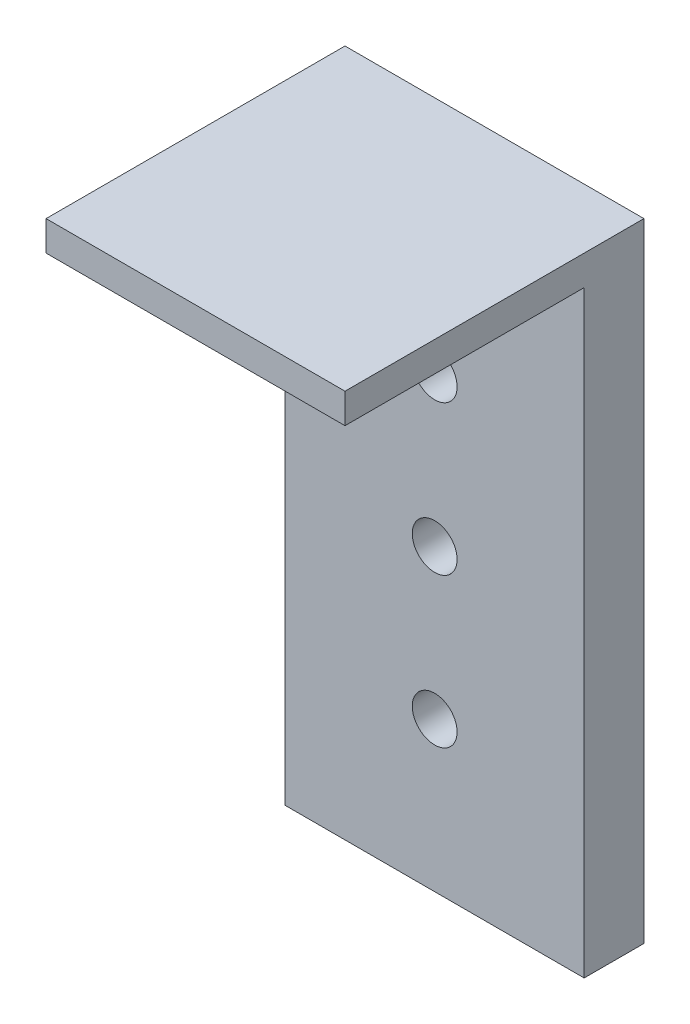
ISO-10303-21;
HEADER;
FILE_DESCRIPTION(('STEP AP214'),'2;1');
FILE_NAME('part.step','',(''),(''),'','','');
FILE_SCHEMA(('AUTOMOTIVE_DESIGN { 1 0 10303 214 1 1 1 1 }'));
ENDSEC;
DATA;
#1=APPLICATION_CONTEXT('core data for automotive mechanical design processes');
#2=APPLICATION_PROTOCOL_DEFINITION('international standard','automotive_design',2000,#1);
#3=PRODUCT_CONTEXT('',#1,'mechanical');
#4=PRODUCT('Part','Part','',(#3));
#5=PRODUCT_RELATED_PRODUCT_CATEGORY('part','',(#4));
#6=PRODUCT_DEFINITION_FORMATION('','',#4);
#7=PRODUCT_DEFINITION_CONTEXT('part definition',#1,'design');
#8=PRODUCT_DEFINITION('design','',#6,#7);
#9=PRODUCT_DEFINITION_SHAPE('','',#8);
#10=(LENGTH_UNIT() NAMED_UNIT(*) SI_UNIT(.MILLI.,.METRE.));
#11=(NAMED_UNIT(*) PLANE_ANGLE_UNIT() SI_UNIT($,.RADIAN.));
#12=(NAMED_UNIT(*) SI_UNIT($,.STERADIAN.) SOLID_ANGLE_UNIT());
#13=UNCERTAINTY_MEASURE_WITH_UNIT(LENGTH_MEASURE(1.E-05),#10,'distance_accuracy_value','');
#14=(GEOMETRIC_REPRESENTATION_CONTEXT(3) GLOBAL_UNCERTAINTY_ASSIGNED_CONTEXT((#13)) GLOBAL_UNIT_ASSIGNED_CONTEXT((#10,
#11,#12)) REPRESENTATION_CONTEXT('',''));
#15=CARTESIAN_POINT('',(0.,0.,0.));
#16=DIRECTION('',(0.,0.,1.));
#17=DIRECTION('',(1.,0.,0.));
#18=AXIS2_PLACEMENT_3D('',#15,#16,#17);
#19=CARTESIAN_POINT('',(0.,9.7150517009582,2.));
#20=DIRECTION('',(1.,0.,0.));
#21=DIRECTION('',(0.,0.,-1.));
#22=AXIS2_PLACEMENT_3D('',#19,#20,#21);
#23=PLANE('',#22);
#24=DIRECTION('',(0.,-1.,0.));
#25=VECTOR('',#24,1.);
#26=CARTESIAN_POINT('',(0.,9.7150517009582,0.));
#27=LINE('',#26,#25);
#28=CARTESIAN_POINT('',(0.,30.7150517009582,0.));
#29=VERTEX_POINT('',#28);
#30=CARTESIAN_POINT('',(0.,9.7150517009582,0.));
#31=VERTEX_POINT('',#30);
#32=EDGE_CURVE('E102',#29,#31,#27,.T.);
#33=ORIENTED_EDGE('',*,*,#32,.T.);
#34=DIRECTION('',(0.,0.,-1.));
#35=VECTOR('',#34,1.);
#36=CARTESIAN_POINT('',(0.,9.7150517009582,2.));
#37=LINE('',#36,#35);
#38=CARTESIAN_POINT('',(0.,9.7150517009582,2.));
#39=VERTEX_POINT('',#38);
#40=EDGE_CURVE('E11',#39,#31,#37,.T.);
#41=ORIENTED_EDGE('',*,*,#40,.F.);
#42=DIRECTION('',(0.,-1.,0.));
#43=VECTOR('',#42,1.);
#44=CARTESIAN_POINT('',(0.,9.7150517009582,2.));
#45=LINE('',#44,#43);
#46=CARTESIAN_POINT('',(0.,29.7150517009582,2.));
#47=VERTEX_POINT('',#46);
#48=EDGE_CURVE('E93',#47,#39,#45,.T.);
#49=ORIENTED_EDGE('',*,*,#48,.F.);
#50=DIRECTION('',(0.,0.,1.));
#51=VECTOR('',#50,1.);
#52=CARTESIAN_POINT('',(0.,29.7150517009582,0.));
#53=LINE('',#52,#51);
#54=CARTESIAN_POINT('',(0.,29.7150517009582,10.));
#55=VERTEX_POINT('',#54);
#56=EDGE_CURVE('E55',#47,#55,#53,.T.);
#57=ORIENTED_EDGE('',*,*,#56,.T.);
#58=DIRECTION('',(0.,-1.,0.));
#59=VECTOR('',#58,1.);
#60=CARTESIAN_POINT('',(0.,30.7150517009582,10.));
#61=LINE('',#60,#59);
#62=CARTESIAN_POINT('',(0.,30.7150517009582,10.));
#63=VERTEX_POINT('',#62);
#64=EDGE_CURVE('E132',#63,#55,#61,.T.);
#65=ORIENTED_EDGE('',*,*,#64,.F.);
#66=DIRECTION('',(0.,0.,1.));
#67=VECTOR('',#66,1.);
#68=CARTESIAN_POINT('',(0.,30.7150517009582,0.));
#69=LINE('',#68,#67);
#70=EDGE_CURVE('E105',#29,#63,#69,.T.);
#71=ORIENTED_EDGE('',*,*,#70,.F.);
#72=EDGE_LOOP('',(#33,#41,#49,#57,#65,#71));
#73=FACE_BOUND('',#72,.T.);
#74=ADVANCED_FACE('F38',(#73),#23,.F.);
#75=CARTESIAN_POINT('',(0.,9.7150517009582,2.));
#76=DIRECTION('',(0.,1.,0.));
#77=DIRECTION('',(0.,0.,1.));
#78=AXIS2_PLACEMENT_3D('',#75,#76,#77);
#79=PLANE('',#78);
#80=DIRECTION('',(1.,0.,0.));
#81=VECTOR('',#80,1.);
#82=CARTESIAN_POINT('',(0.,9.7150517009582,0.));
#83=LINE('',#82,#81);
#84=CARTESIAN_POINT('',(10.,9.7150517009582,0.));
#85=VERTEX_POINT('',#84);
#86=EDGE_CURVE('E68',#31,#85,#83,.T.);
#87=ORIENTED_EDGE('',*,*,#86,.T.);
#88=DIRECTION('',(0.,0.,-1.));
#89=VECTOR('',#88,1.);
#90=CARTESIAN_POINT('',(10.,9.7150517009582,2.));
#91=LINE('',#90,#89);
#92=CARTESIAN_POINT('',(10.,9.7150517009582,2.));
#93=VERTEX_POINT('',#92);
#94=EDGE_CURVE('E47',#93,#85,#91,.T.);
#95=ORIENTED_EDGE('',*,*,#94,.F.);
#96=DIRECTION('',(1.,0.,0.));
#97=VECTOR('',#96,1.);
#98=CARTESIAN_POINT('',(0.,9.7150517009582,2.));
#99=LINE('',#98,#97);
#100=EDGE_CURVE('E82',#39,#93,#99,.T.);
#101=ORIENTED_EDGE('',*,*,#100,.F.);
#102=ORIENTED_EDGE('',*,*,#40,.T.);
#103=EDGE_LOOP('',(#87,#95,#101,#102));
#104=FACE_BOUND('',#103,.T.);
#105=ADVANCED_FACE('F84',(#104),#79,.F.);
#106=CARTESIAN_POINT('',(10.,9.7150517009582,2.));
#107=DIRECTION('',(-1.,0.,0.));
#108=DIRECTION('',(0.,0.,1.));
#109=AXIS2_PLACEMENT_3D('',#106,#107,#108);
#110=PLANE('',#109);
#111=DIRECTION('',(0.,1.,0.));
#112=VECTOR('',#111,1.);
#113=CARTESIAN_POINT('',(10.,9.7150517009582,0.));
#114=LINE('',#113,#112);
#115=CARTESIAN_POINT('',(10.,30.7150517009582,0.));
#116=VERTEX_POINT('',#115);
#117=EDGE_CURVE('E99',#85,#116,#114,.T.);
#118=ORIENTED_EDGE('',*,*,#117,.T.);
#119=DIRECTION('',(0.,0.,-1.));
#120=VECTOR('',#119,1.);
#121=CARTESIAN_POINT('',(10.,30.7150517009582,0.));
#122=LINE('',#121,#120);
#123=CARTESIAN_POINT('',(10.,30.7150517009582,10.));
#124=VERTEX_POINT('',#123);
#125=EDGE_CURVE('E166',#124,#116,#122,.T.);
#126=ORIENTED_EDGE('',*,*,#125,.F.);
#127=DIRECTION('',(0.,-1.,0.));
#128=VECTOR('',#127,1.);
#129=CARTESIAN_POINT('',(10.,30.7150517009582,10.));
#130=LINE('',#129,#128);
#131=CARTESIAN_POINT('',(10.,29.7150517009582,10.));
#132=VERTEX_POINT('',#131);
#133=EDGE_CURVE('E150',#124,#132,#130,.T.);
#134=ORIENTED_EDGE('',*,*,#133,.T.);
#135=DIRECTION('',(0.,0.,-1.));
#136=VECTOR('',#135,1.);
#137=CARTESIAN_POINT('',(10.,29.7150517009582,0.));
#138=LINE('',#137,#136);
#139=CARTESIAN_POINT('',(10.,29.7150517009582,2.));
#140=VERTEX_POINT('',#139);
#141=EDGE_CURVE('E155',#132,#140,#138,.T.);
#142=ORIENTED_EDGE('',*,*,#141,.T.);
#143=DIRECTION('',(0.,1.,0.));
#144=VECTOR('',#143,1.);
#145=CARTESIAN_POINT('',(10.,9.7150517009582,2.));
#146=LINE('',#145,#144);
#147=EDGE_CURVE('E92',#93,#140,#146,.T.);
#148=ORIENTED_EDGE('',*,*,#147,.F.);
#149=ORIENTED_EDGE('',*,*,#94,.T.);
#150=EDGE_LOOP('',(#118,#126,#134,#142,#148,#149));
#151=FACE_BOUND('',#150,.T.);
#152=ADVANCED_FACE('F188',(#151),#110,.F.);
#153=CARTESIAN_POINT('',(0.,0.,2.));
#154=DIRECTION('',(0.,0.,-1.));
#155=DIRECTION('',(-1.,0.,0.));
#156=AXIS2_PLACEMENT_3D('',#153,#154,#155);
#157=PLANE('',#156);
#158=CARTESIAN_POINT('',(5.,24.7150517009582,2.));
#159=DIRECTION('',(0.,0.,1.));
#160=DIRECTION('',(1.,0.,0.));
#161=AXIS2_PLACEMENT_3D('',#158,#159,#160);
#162=CIRCLE('',#161,0.75);
#163=CARTESIAN_POINT('',(5.75,24.7150517009582,2.));
#164=VERTEX_POINT('',#163);
#165=EDGE_CURVE('E109',#164,#164,#162,.T.);
#166=ORIENTED_EDGE('',*,*,#165,.F.);
#167=EDGE_LOOP('',(#166));
#168=FACE_BOUND('',#167,.T.);
#169=CARTESIAN_POINT('',(5.,19.7150517009582,2.));
#170=DIRECTION('',(0.,0.,1.));
#171=DIRECTION('',(1.,0.,0.));
#172=AXIS2_PLACEMENT_3D('',#169,#170,#171);
#173=CIRCLE('',#172,0.75);
#174=CARTESIAN_POINT('',(5.75,19.7150517009582,2.));
#175=VERTEX_POINT('',#174);
#176=EDGE_CURVE('E140',#175,#175,#173,.T.);
#177=ORIENTED_EDGE('',*,*,#176,.F.);
#178=EDGE_LOOP('',(#177));
#179=FACE_BOUND('',#178,.T.);
#180=CARTESIAN_POINT('',(5.,14.7150517009582,2.));
#181=DIRECTION('',(0.,0.,1.));
#182=DIRECTION('',(1.,0.,0.));
#183=AXIS2_PLACEMENT_3D('',#180,#181,#182);
#184=CIRCLE('',#183,0.75);
#185=CARTESIAN_POINT('',(5.75,14.7150517009582,2.));
#186=VERTEX_POINT('',#185);
#187=EDGE_CURVE('E131',#186,#186,#184,.T.);
#188=ORIENTED_EDGE('',*,*,#187,.F.);
#189=EDGE_LOOP('',(#188));
#190=FACE_BOUND('',#189,.T.);
#191=ORIENTED_EDGE('',*,*,#48,.T.);
#192=ORIENTED_EDGE('',*,*,#100,.T.);
#193=ORIENTED_EDGE('',*,*,#147,.T.);
#194=DIRECTION('',(-1.,0.,0.));
#195=VECTOR('',#194,1.);
#196=CARTESIAN_POINT('',(0.,29.7150517009582,2.));
#197=LINE('',#196,#195);
#198=EDGE_CURVE('E72',#140,#47,#197,.T.);
#199=ORIENTED_EDGE('',*,*,#198,.T.);
#200=EDGE_LOOP('',(#191,#192,#193,#199));
#201=FACE_BOUND('',#200,.T.);
#202=ADVANCED_FACE('F96',(#168,#179,#190,#201),#157,.F.);
#203=CARTESIAN_POINT('',(0.,0.,0.));
#204=DIRECTION('',(0.,0.,-1.));
#205=DIRECTION('',(-1.,0.,0.));
#206=AXIS2_PLACEMENT_3D('',#203,#204,#205);
#207=PLANE('',#206);
#208=CARTESIAN_POINT('',(5.,24.7150517009582,0.));
#209=DIRECTION('',(0.,0.,1.));
#210=DIRECTION('',(1.,0.,0.));
#211=AXIS2_PLACEMENT_3D('',#208,#209,#210);
#212=CIRCLE('',#211,0.75);
#213=CARTESIAN_POINT('',(5.75,24.7150517009582,0.));
#214=VERTEX_POINT('',#213);
#215=EDGE_CURVE('E115',#214,#214,#212,.T.);
#216=ORIENTED_EDGE('',*,*,#215,.T.);
#217=EDGE_LOOP('',(#216));
#218=FACE_BOUND('',#217,.T.);
#219=CARTESIAN_POINT('',(5.,19.7150517009582,0.));
#220=DIRECTION('',(0.,0.,1.));
#221=DIRECTION('',(1.,0.,0.));
#222=AXIS2_PLACEMENT_3D('',#219,#220,#221);
#223=CIRCLE('',#222,0.75);
#224=CARTESIAN_POINT('',(5.75,19.7150517009582,0.));
#225=VERTEX_POINT('',#224);
#226=EDGE_CURVE('E136',#225,#225,#223,.T.);
#227=ORIENTED_EDGE('',*,*,#226,.T.);
#228=EDGE_LOOP('',(#227));
#229=FACE_BOUND('',#228,.T.);
#230=CARTESIAN_POINT('',(5.,14.7150517009582,0.));
#231=DIRECTION('',(0.,0.,1.));
#232=DIRECTION('',(1.,0.,0.));
#233=AXIS2_PLACEMENT_3D('',#230,#231,#232);
#234=CIRCLE('',#233,0.75);
#235=CARTESIAN_POINT('',(5.75,14.7150517009582,0.));
#236=VERTEX_POINT('',#235);
#237=EDGE_CURVE('E127',#236,#236,#234,.T.);
#238=ORIENTED_EDGE('',*,*,#237,.T.);
#239=EDGE_LOOP('',(#238));
#240=FACE_BOUND('',#239,.T.);
#241=ORIENTED_EDGE('',*,*,#32,.F.);
#242=DIRECTION('',(-1.,0.,0.));
#243=VECTOR('',#242,1.);
#244=CARTESIAN_POINT('',(0.,30.7150517009582,0.));
#245=LINE('',#244,#243);
#246=EDGE_CURVE('E154',#116,#29,#245,.T.);
#247=ORIENTED_EDGE('',*,*,#246,.F.);
#248=ORIENTED_EDGE('',*,*,#117,.F.);
#249=ORIENTED_EDGE('',*,*,#86,.F.);
#250=EDGE_LOOP('',(#241,#247,#248,#249));
#251=FACE_BOUND('',#250,.T.);
#252=ADVANCED_FACE('F189',(#218,#229,#240,#251),#207,.T.);
#253=CARTESIAN_POINT('',(5.,14.7150517009582,2.));
#254=DIRECTION('',(0.,0.,-1.));
#255=DIRECTION('',(-1.,0.,0.));
#256=AXIS2_PLACEMENT_3D('',#253,#254,#255);
#257=CYLINDRICAL_SURFACE('',#256,0.75);
#258=ORIENTED_EDGE('',*,*,#187,.T.);
#259=EDGE_LOOP('',(#258));
#260=FACE_BOUND('',#259,.T.);
#261=ORIENTED_EDGE('',*,*,#237,.F.);
#262=EDGE_LOOP('',(#261));
#263=FACE_BOUND('',#262,.T.);
#264=ADVANCED_FACE('F191',(#260,#263),#257,.F.);
#265=CARTESIAN_POINT('',(5.,19.7150517009582,2.));
#266=DIRECTION('',(0.,0.,-1.));
#267=DIRECTION('',(-1.,0.,0.));
#268=AXIS2_PLACEMENT_3D('',#265,#266,#267);
#269=CYLINDRICAL_SURFACE('',#268,0.75);
#270=ORIENTED_EDGE('',*,*,#176,.T.);
#271=EDGE_LOOP('',(#270));
#272=FACE_BOUND('',#271,.T.);
#273=ORIENTED_EDGE('',*,*,#226,.F.);
#274=EDGE_LOOP('',(#273));
#275=FACE_BOUND('',#274,.T.);
#276=ADVANCED_FACE('F198',(#272,#275),#269,.F.);
#277=CARTESIAN_POINT('',(5.,24.7150517009582,2.));
#278=DIRECTION('',(0.,0.,-1.));
#279=DIRECTION('',(-1.,0.,0.));
#280=AXIS2_PLACEMENT_3D('',#277,#278,#279);
#281=CYLINDRICAL_SURFACE('',#280,0.75);
#282=ORIENTED_EDGE('',*,*,#165,.T.);
#283=EDGE_LOOP('',(#282));
#284=FACE_BOUND('',#283,.T.);
#285=ORIENTED_EDGE('',*,*,#215,.F.);
#286=EDGE_LOOP('',(#285));
#287=FACE_BOUND('',#286,.T.);
#288=ADVANCED_FACE('F233',(#284,#287),#281,.F.);
#289=CARTESIAN_POINT('',(0.,30.7150517009582,10.));
#290=DIRECTION('',(0.,0.,-1.));
#291=DIRECTION('',(-1.,0.,0.));
#292=AXIS2_PLACEMENT_3D('',#289,#290,#291);
#293=PLANE('',#292);
#294=DIRECTION('',(1.,0.,0.));
#295=VECTOR('',#294,1.);
#296=CARTESIAN_POINT('',(0.,29.7150517009582,10.));
#297=LINE('',#296,#295);
#298=EDGE_CURVE('E158',#55,#132,#297,.T.);
#299=ORIENTED_EDGE('',*,*,#298,.T.);
#300=ORIENTED_EDGE('',*,*,#133,.F.);
#301=DIRECTION('',(1.,0.,0.));
#302=VECTOR('',#301,1.);
#303=CARTESIAN_POINT('',(0.,30.7150517009582,10.));
#304=LINE('',#303,#302);
#305=EDGE_CURVE('E170',#63,#124,#304,.T.);
#306=ORIENTED_EDGE('',*,*,#305,.F.);
#307=ORIENTED_EDGE('',*,*,#64,.T.);
#308=EDGE_LOOP('',(#299,#300,#306,#307));
#309=FACE_BOUND('',#308,.T.);
#310=ADVANCED_FACE('F184',(#309),#293,.F.);
#311=CARTESIAN_POINT('',(0.,30.7150517009582,0.));
#312=DIRECTION('',(0.,1.,0.));
#313=DIRECTION('',(0.,0.,1.));
#314=AXIS2_PLACEMENT_3D('',#311,#312,#313);
#315=PLANE('',#314);
#316=ORIENTED_EDGE('',*,*,#70,.T.);
#317=ORIENTED_EDGE('',*,*,#305,.T.);
#318=ORIENTED_EDGE('',*,*,#125,.T.);
#319=ORIENTED_EDGE('',*,*,#246,.T.);
#320=EDGE_LOOP('',(#316,#317,#318,#319));
#321=FACE_BOUND('',#320,.T.);
#322=ADVANCED_FACE('F177',(#321),#315,.T.);
#323=CARTESIAN_POINT('',(0.,29.7150517009582,0.));
#324=DIRECTION('',(0.,1.,0.));
#325=DIRECTION('',(0.,0.,1.));
#326=AXIS2_PLACEMENT_3D('',#323,#324,#325);
#327=PLANE('',#326);
#328=ORIENTED_EDGE('',*,*,#198,.F.);
#329=ORIENTED_EDGE('',*,*,#141,.F.);
#330=ORIENTED_EDGE('',*,*,#298,.F.);
#331=ORIENTED_EDGE('',*,*,#56,.F.);
#332=EDGE_LOOP('',(#328,#329,#330,#331));
#333=FACE_BOUND('',#332,.T.);
#334=ADVANCED_FACE('F243',(#333),#327,.F.);
#335=CLOSED_SHELL('',(#74,#105,#152,#202,#252,#264,#276,#288,#310,#322,#334));
#336=MANIFOLD_SOLID_BREP('B2',#335);
#337=ADVANCED_BREP_SHAPE_REPRESENTATION('',(#18,#336),#14);
#338=SHAPE_DEFINITION_REPRESENTATION(#9,#337);
ENDSEC;
END-ISO-10303-21;
